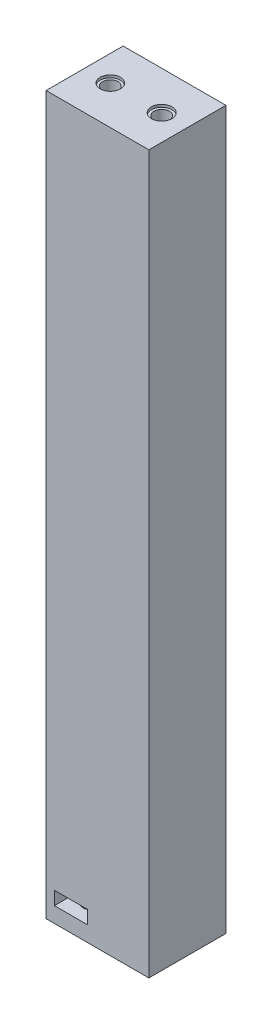
ISO-10303-21;
HEADER;
FILE_DESCRIPTION(('STEP AP214'),'2;1');
FILE_NAME('part.step','',(''),(''),'','','');
FILE_SCHEMA(('AUTOMOTIVE_DESIGN { 1 0 10303 214 1 1 1 1 }'));
ENDSEC;
DATA;
#1=APPLICATION_CONTEXT('core data for automotive mechanical design processes');
#2=APPLICATION_PROTOCOL_DEFINITION('international standard','automotive_design',2000,#1);
#3=PRODUCT_CONTEXT('',#1,'mechanical');
#4=PRODUCT('Part','Part','',(#3));
#5=PRODUCT_RELATED_PRODUCT_CATEGORY('part','',(#4));
#6=PRODUCT_DEFINITION_FORMATION('','',#4);
#7=PRODUCT_DEFINITION_CONTEXT('part definition',#1,'design');
#8=PRODUCT_DEFINITION('design','',#6,#7);
#9=PRODUCT_DEFINITION_SHAPE('','',#8);
#10=(LENGTH_UNIT() NAMED_UNIT(*) SI_UNIT(.MILLI.,.METRE.));
#11=(NAMED_UNIT(*) PLANE_ANGLE_UNIT() SI_UNIT($,.RADIAN.));
#12=(NAMED_UNIT(*) SI_UNIT($,.STERADIAN.) SOLID_ANGLE_UNIT());
#13=UNCERTAINTY_MEASURE_WITH_UNIT(LENGTH_MEASURE(1.E-05),#10,'distance_accuracy_value','');
#14=(GEOMETRIC_REPRESENTATION_CONTEXT(3) GLOBAL_UNCERTAINTY_ASSIGNED_CONTEXT((#13)) GLOBAL_UNIT_ASSIGNED_CONTEXT((#10,
#11,#12)) REPRESENTATION_CONTEXT('',''));
#15=CARTESIAN_POINT('',(0.,0.,0.));
#16=DIRECTION('',(0.,0.,1.));
#17=DIRECTION('',(1.,0.,0.));
#18=AXIS2_PLACEMENT_3D('',#15,#16,#17);
#19=CARTESIAN_POINT('',(0.,2.6,0.15));
#20=DIRECTION('',(0.,0.,1.));
#21=DIRECTION('',(1.,0.,0.));
#22=AXIS2_PLACEMENT_3D('',#19,#20,#21);
#23=PLANE('',#22);
#24=DIRECTION('',(-1.,0.,0.));
#25=VECTOR('',#24,1.);
#26=CARTESIAN_POINT('',(0.,0.,0.15));
#27=LINE('',#26,#25);
#28=CARTESIAN_POINT('',(8.2,0.,0.15));
#29=VERTEX_POINT('',#28);
#30=CARTESIAN_POINT('',(1.8,0.,0.15));
#31=VERTEX_POINT('',#30);
#32=EDGE_CURVE('E194',#29,#31,#27,.T.);
#33=ORIENTED_EDGE('',*,*,#32,.T.);
#34=DIRECTION('',(0.,-1.,0.));
#35=VECTOR('',#34,1.);
#36=CARTESIAN_POINT('',(1.8,2.6,0.15));
#37=LINE('',#36,#35);
#38=CARTESIAN_POINT('',(1.8,2.6,0.15));
#39=VERTEX_POINT('',#38);
#40=EDGE_CURVE('E11',#39,#31,#37,.T.);
#41=ORIENTED_EDGE('',*,*,#40,.F.);
#42=DIRECTION('',(-1.,0.,0.));
#43=VECTOR('',#42,1.);
#44=CARTESIAN_POINT('',(0.,2.6,0.15));
#45=LINE('',#44,#43);
#46=CARTESIAN_POINT('',(8.2,2.6,0.15));
#47=VERTEX_POINT('',#46);
#48=EDGE_CURVE('E209',#47,#39,#45,.T.);
#49=ORIENTED_EDGE('',*,*,#48,.F.);
#50=DIRECTION('',(0.,-1.,0.));
#51=VECTOR('',#50,1.);
#52=CARTESIAN_POINT('',(8.2,2.6,0.15));
#53=LINE('',#52,#51);
#54=EDGE_CURVE('E231',#47,#29,#53,.T.);
#55=ORIENTED_EDGE('',*,*,#54,.T.);
#56=EDGE_LOOP('',(#33,#41,#49,#55));
#57=FACE_BOUND('',#56,.T.);
#58=ADVANCED_FACE('F40',(#57),#23,.F.);
#59=CARTESIAN_POINT('',(1.8,2.6,0.));
#60=DIRECTION('',(-1.,0.,0.));
#61=DIRECTION('',(0.,0.,1.));
#62=AXIS2_PLACEMENT_3D('',#59,#60,#61);
#63=PLANE('',#62);
#64=DIRECTION('',(0.,0.,-1.));
#65=VECTOR('',#64,1.);
#66=CARTESIAN_POINT('',(1.8,0.,0.));
#67=LINE('',#66,#65);
#68=CARTESIAN_POINT('',(1.8,0.,-7.59292642862094));
#69=VERTEX_POINT('',#68);
#70=EDGE_CURVE('E235',#31,#69,#67,.T.);
#71=ORIENTED_EDGE('',*,*,#70,.T.);
#72=DIRECTION('',(0.,-1.,0.));
#73=VECTOR('',#72,1.);
#74=CARTESIAN_POINT('',(1.8,2.6,-7.59292642862094));
#75=LINE('',#74,#73);
#76=CARTESIAN_POINT('',(1.8,2.6,-7.59292642862094));
#77=VERTEX_POINT('',#76);
#78=EDGE_CURVE('E50',#77,#69,#75,.T.);
#79=ORIENTED_EDGE('',*,*,#78,.F.);
#80=DIRECTION('',(0.,0.,-1.));
#81=VECTOR('',#80,1.);
#82=CARTESIAN_POINT('',(1.8,2.6,0.));
#83=LINE('',#82,#81);
#84=EDGE_CURVE('E212',#39,#77,#83,.T.);
#85=ORIENTED_EDGE('',*,*,#84,.F.);
#86=ORIENTED_EDGE('',*,*,#40,.T.);
#87=EDGE_LOOP('',(#71,#79,#85,#86));
#88=FACE_BOUND('',#87,.T.);
#89=ADVANCED_FACE('F353',(#88),#63,.F.);
#90=CARTESIAN_POINT('',(-9.81414714275812,2.6,0.));
#91=DIRECTION('',(1.,0.,0.));
#92=DIRECTION('',(0.,0.,-1.));
#93=AXIS2_PLACEMENT_3D('',#90,#91,#92);
#94=PLANE('',#93);
#95=DIRECTION('',(0.,-1.,0.));
#96=VECTOR('',#95,1.);
#97=CARTESIAN_POINT('',(-9.81414714275812,2.6,-7.59292642862094));
#98=LINE('',#97,#96);
#99=CARTESIAN_POINT('',(-9.81414714275812,136.6,-7.59292642862094));
#100=VERTEX_POINT('',#99);
#101=CARTESIAN_POINT('',(-9.81414714275812,-3.,-7.59292642862094));
#102=VERTEX_POINT('',#101);
#103=EDGE_CURVE('E278',#100,#102,#98,.T.);
#104=ORIENTED_EDGE('',*,*,#103,.T.);
#105=DIRECTION('',(0.,0.,-1.));
#106=VECTOR('',#105,1.);
#107=CARTESIAN_POINT('',(-9.81414714275812,-3.,0.));
#108=LINE('',#107,#106);
#109=CARTESIAN_POINT('',(-9.81414714275812,-3.,7.40707357137906));
#110=VERTEX_POINT('',#109);
#111=EDGE_CURVE('E172',#110,#102,#108,.T.);
#112=ORIENTED_EDGE('',*,*,#111,.F.);
#113=DIRECTION('',(0.,-1.,0.));
#114=VECTOR('',#113,1.);
#115=CARTESIAN_POINT('',(-9.81414714275812,2.6,7.40707357137906));
#116=LINE('',#115,#114);
#117=CARTESIAN_POINT('',(-9.81414714275812,136.6,7.40707357137906));
#118=VERTEX_POINT('',#117);
#119=EDGE_CURVE('E275',#118,#110,#116,.T.);
#120=ORIENTED_EDGE('',*,*,#119,.F.);
#121=DIRECTION('',(0.,0.,1.));
#122=VECTOR('',#121,1.);
#123=CARTESIAN_POINT('',(-9.81414714275812,136.6,0.));
#124=LINE('',#123,#122);
#125=EDGE_CURVE('E153',#100,#118,#124,.T.);
#126=ORIENTED_EDGE('',*,*,#125,.F.);
#127=EDGE_LOOP('',(#104,#112,#120,#126));
#128=FACE_BOUND('',#127,.T.);
#129=ADVANCED_FACE('F377',(#128),#94,.F.);
#130=CARTESIAN_POINT('',(-8.2,2.6,0.));
#131=DIRECTION('',(1.,0.,0.));
#132=DIRECTION('',(0.,0.,-1.));
#133=AXIS2_PLACEMENT_3D('',#130,#131,#132);
#134=PLANE('',#133);
#135=DIRECTION('',(0.,0.,1.));
#136=VECTOR('',#135,1.);
#137=CARTESIAN_POINT('',(-8.2,0.,0.));
#138=LINE('',#137,#136);
#139=CARTESIAN_POINT('',(-8.2,0.,-0.15));
#140=VERTEX_POINT('',#139);
#141=CARTESIAN_POINT('',(-8.2,0.,7.40707357137906));
#142=VERTEX_POINT('',#141);
#143=EDGE_CURVE('E239',#140,#142,#138,.T.);
#144=ORIENTED_EDGE('',*,*,#143,.F.);
#145=DIRECTION('',(0.,-1.,0.));
#146=VECTOR('',#145,1.);
#147=CARTESIAN_POINT('',(-8.2,2.6,-0.15));
#148=LINE('',#147,#146);
#149=CARTESIAN_POINT('',(-8.2,2.6,-0.15));
#150=VERTEX_POINT('',#149);
#151=EDGE_CURVE('E267',#150,#140,#148,.T.);
#152=ORIENTED_EDGE('',*,*,#151,.F.);
#153=DIRECTION('',(0.,0.,1.));
#154=VECTOR('',#153,1.);
#155=CARTESIAN_POINT('',(-8.2,2.6,0.));
#156=LINE('',#155,#154);
#157=CARTESIAN_POINT('',(-8.2,2.6,7.40707357137906));
#158=VERTEX_POINT('',#157);
#159=EDGE_CURVE('E216',#150,#158,#156,.T.);
#160=ORIENTED_EDGE('',*,*,#159,.T.);
#161=DIRECTION('',(0.,-1.,0.));
#162=VECTOR('',#161,1.);
#163=CARTESIAN_POINT('',(-8.2,2.6,7.40707357137906));
#164=LINE('',#163,#162);
#165=EDGE_CURVE('E271',#158,#142,#164,.T.);
#166=ORIENTED_EDGE('',*,*,#165,.T.);
#167=EDGE_LOOP('',(#144,#152,#160,#166));
#168=FACE_BOUND('',#167,.T.);
#169=ADVANCED_FACE('F381',(#168),#134,.T.);
#170=CARTESIAN_POINT('',(0.,2.6,-0.15));
#171=DIRECTION('',(0.,0.,1.));
#172=DIRECTION('',(1.,0.,0.));
#173=AXIS2_PLACEMENT_3D('',#170,#171,#172);
#174=PLANE('',#173);
#175=DIRECTION('',(-1.,0.,0.));
#176=VECTOR('',#175,1.);
#177=CARTESIAN_POINT('',(0.,0.,-0.15));
#178=LINE('',#177,#176);
#179=CARTESIAN_POINT('',(-1.8,0.,-0.15));
#180=VERTEX_POINT('',#179);
#181=EDGE_CURVE('E242',#180,#140,#178,.T.);
#182=ORIENTED_EDGE('',*,*,#181,.F.);
#183=DIRECTION('',(0.,-1.,0.));
#184=VECTOR('',#183,1.);
#185=CARTESIAN_POINT('',(-1.8,2.6,-0.15));
#186=LINE('',#185,#184);
#187=CARTESIAN_POINT('',(-1.8,2.6,-0.15));
#188=VERTEX_POINT('',#187);
#189=EDGE_CURVE('E263',#188,#180,#186,.T.);
#190=ORIENTED_EDGE('',*,*,#189,.F.);
#191=DIRECTION('',(-1.,0.,0.));
#192=VECTOR('',#191,1.);
#193=CARTESIAN_POINT('',(0.,2.6,-0.15));
#194=LINE('',#193,#192);
#195=EDGE_CURVE('E220',#188,#150,#194,.T.);
#196=ORIENTED_EDGE('',*,*,#195,.T.);
#197=ORIENTED_EDGE('',*,*,#151,.T.);
#198=EDGE_LOOP('',(#182,#190,#196,#197));
#199=FACE_BOUND('',#198,.T.);
#200=ADVANCED_FACE('F387',(#199),#174,.T.);
#201=CARTESIAN_POINT('',(-1.8,2.6,0.));
#202=DIRECTION('',(1.,0.,0.));
#203=DIRECTION('',(0.,0.,-1.));
#204=AXIS2_PLACEMENT_3D('',#201,#202,#203);
#205=PLANE('',#204);
#206=DIRECTION('',(0.,0.,1.));
#207=VECTOR('',#206,1.);
#208=CARTESIAN_POINT('',(-1.8,0.,0.));
#209=LINE('',#208,#207);
#210=CARTESIAN_POINT('',(-1.8,0.,7.40707357137906));
#211=VERTEX_POINT('',#210);
#212=EDGE_CURVE('E245',#180,#211,#209,.T.);
#213=ORIENTED_EDGE('',*,*,#212,.T.);
#214=DIRECTION('',(0.,-1.,0.));
#215=VECTOR('',#214,1.);
#216=CARTESIAN_POINT('',(-1.8,2.6,7.40707357137906));
#217=LINE('',#216,#215);
#218=CARTESIAN_POINT('',(-1.8,2.6,7.40707357137906));
#219=VERTEX_POINT('',#218);
#220=EDGE_CURVE('E138',#219,#211,#217,.T.);
#221=ORIENTED_EDGE('',*,*,#220,.F.);
#222=DIRECTION('',(0.,0.,1.));
#223=VECTOR('',#222,1.);
#224=CARTESIAN_POINT('',(-1.8,2.6,0.));
#225=LINE('',#224,#223);
#226=EDGE_CURVE('E224',#188,#219,#225,.T.);
#227=ORIENTED_EDGE('',*,*,#226,.F.);
#228=ORIENTED_EDGE('',*,*,#189,.T.);
#229=EDGE_LOOP('',(#213,#221,#227,#228));
#230=FACE_BOUND('',#229,.T.);
#231=ADVANCED_FACE('F391',(#230),#205,.F.);
#232=CARTESIAN_POINT('',(0.,2.6,7.40707357137906));
#233=DIRECTION('',(0.,0.,-1.));
#234=DIRECTION('',(-1.,0.,0.));
#235=AXIS2_PLACEMENT_3D('',#232,#233,#234);
#236=PLANE('',#235);
#237=ORIENTED_EDGE('',*,*,#165,.F.);
#238=DIRECTION('',(1.,0.,0.));
#239=VECTOR('',#238,1.);
#240=CARTESIAN_POINT('',(0.,2.6,7.40707357137906));
#241=LINE('',#240,#239);
#242=EDGE_CURVE('E157',#158,#219,#241,.T.);
#243=ORIENTED_EDGE('',*,*,#242,.T.);
#244=ORIENTED_EDGE('',*,*,#220,.T.);
#245=DIRECTION('',(-1.,0.,0.));
#246=VECTOR('',#245,1.);
#247=CARTESIAN_POINT('',(0.,0.,7.40707357137906));
#248=LINE('',#247,#246);
#249=EDGE_CURVE('E198',#211,#142,#248,.T.);
#250=ORIENTED_EDGE('',*,*,#249,.T.);
#251=EDGE_LOOP('',(#237,#243,#244,#250));
#252=FACE_BOUND('',#251,.T.);
#253=DIRECTION('',(1.,0.,0.));
#254=VECTOR('',#253,1.);
#255=CARTESIAN_POINT('',(0.,136.6,7.40707357137906));
#256=LINE('',#255,#254);
#257=CARTESIAN_POINT('',(10.1858528572419,136.6,7.40707357137906));
#258=VERTEX_POINT('',#257);
#259=EDGE_CURVE('E131',#118,#258,#256,.T.);
#260=ORIENTED_EDGE('',*,*,#259,.F.);
#261=ORIENTED_EDGE('',*,*,#119,.T.);
#262=DIRECTION('',(-1.,0.,0.));
#263=VECTOR('',#262,1.);
#264=CARTESIAN_POINT('',(0.,-3.,7.40707357137906));
#265=LINE('',#264,#263);
#266=CARTESIAN_POINT('',(10.1858528572419,-3.,7.40707357137906));
#267=VERTEX_POINT('',#266);
#268=EDGE_CURVE('E133',#267,#110,#265,.T.);
#269=ORIENTED_EDGE('',*,*,#268,.F.);
#270=DIRECTION('',(0.,-1.,0.));
#271=VECTOR('',#270,1.);
#272=CARTESIAN_POINT('',(10.1858528572419,2.6,7.40707357137906));
#273=LINE('',#272,#271);
#274=EDGE_CURVE('E127',#258,#267,#273,.T.);
#275=ORIENTED_EDGE('',*,*,#274,.F.);
#276=EDGE_LOOP('',(#260,#261,#269,#275));
#277=FACE_BOUND('',#276,.T.);
#278=ADVANCED_FACE('F129',(#252,#277),#236,.F.);
#279=CARTESIAN_POINT('',(10.1858528572419,2.6,0.));
#280=DIRECTION('',(1.,0.,0.));
#281=DIRECTION('',(0.,0.,-1.));
#282=AXIS2_PLACEMENT_3D('',#279,#280,#281);
#283=PLANE('',#282);
#284=ORIENTED_EDGE('',*,*,#274,.T.);
#285=DIRECTION('',(0.,0.,1.));
#286=VECTOR('',#285,1.);
#287=CARTESIAN_POINT('',(10.1858528572419,-3.,0.));
#288=LINE('',#287,#286);
#289=CARTESIAN_POINT('',(10.1858528572419,-3.,-7.59292642862094));
#290=VERTEX_POINT('',#289);
#291=EDGE_CURVE('E181',#290,#267,#288,.T.);
#292=ORIENTED_EDGE('',*,*,#291,.F.);
#293=DIRECTION('',(0.,-1.,0.));
#294=VECTOR('',#293,1.);
#295=CARTESIAN_POINT('',(10.1858528572419,2.6,-7.59292642862094));
#296=LINE('',#295,#294);
#297=CARTESIAN_POINT('',(10.1858528572419,136.6,-7.59292642862094));
#298=VERTEX_POINT('',#297);
#299=EDGE_CURVE('E139',#298,#290,#296,.T.);
#300=ORIENTED_EDGE('',*,*,#299,.F.);
#301=DIRECTION('',(0.,0.,-1.));
#302=VECTOR('',#301,1.);
#303=CARTESIAN_POINT('',(10.1858528572419,136.6,0.));
#304=LINE('',#303,#302);
#305=EDGE_CURVE('E142',#258,#298,#304,.T.);
#306=ORIENTED_EDGE('',*,*,#305,.F.);
#307=EDGE_LOOP('',(#284,#292,#300,#306));
#308=FACE_BOUND('',#307,.T.);
#309=ADVANCED_FACE('F143',(#308),#283,.T.);
#310=CARTESIAN_POINT('',(0.,2.6,-7.59292642862094));
#311=DIRECTION('',(0.,0.,1.));
#312=DIRECTION('',(1.,0.,0.));
#313=AXIS2_PLACEMENT_3D('',#310,#311,#312);
#314=PLANE('',#313);
#315=ORIENTED_EDGE('',*,*,#103,.F.);
#316=DIRECTION('',(-1.,0.,0.));
#317=VECTOR('',#316,1.);
#318=CARTESIAN_POINT('',(0.,136.6,-7.59292642862094));
#319=LINE('',#318,#317);
#320=EDGE_CURVE('E148',#298,#100,#319,.T.);
#321=ORIENTED_EDGE('',*,*,#320,.F.);
#322=ORIENTED_EDGE('',*,*,#299,.T.);
#323=DIRECTION('',(1.,0.,0.));
#324=VECTOR('',#323,1.);
#325=CARTESIAN_POINT('',(0.,-3.,-7.59292642862094));
#326=LINE('',#325,#324);
#327=EDGE_CURVE('E176',#102,#290,#326,.T.);
#328=ORIENTED_EDGE('',*,*,#327,.F.);
#329=EDGE_LOOP('',(#315,#321,#322,#328));
#330=FACE_BOUND('',#329,.T.);
#331=DIRECTION('',(-1.,0.,0.));
#332=VECTOR('',#331,1.);
#333=CARTESIAN_POINT('',(0.,2.6,-7.59292642862094));
#334=LINE('',#333,#332);
#335=CARTESIAN_POINT('',(8.2,2.6,-7.59292642862094));
#336=VERTEX_POINT('',#335);
#337=EDGE_CURVE('E57',#336,#77,#334,.T.);
#338=ORIENTED_EDGE('',*,*,#337,.T.);
#339=ORIENTED_EDGE('',*,*,#78,.T.);
#340=DIRECTION('',(1.,0.,0.));
#341=VECTOR('',#340,1.);
#342=CARTESIAN_POINT('',(0.,0.,-7.59292642862094));
#343=LINE('',#342,#341);
#344=CARTESIAN_POINT('',(8.2,0.,-7.59292642862094));
#345=VERTEX_POINT('',#344);
#346=EDGE_CURVE('E167',#69,#345,#343,.T.);
#347=ORIENTED_EDGE('',*,*,#346,.T.);
#348=DIRECTION('',(0.,-1.,0.));
#349=VECTOR('',#348,1.);
#350=CARTESIAN_POINT('',(8.2,2.6,-7.59292642862094));
#351=LINE('',#350,#349);
#352=EDGE_CURVE('E254',#336,#345,#351,.T.);
#353=ORIENTED_EDGE('',*,*,#352,.F.);
#354=EDGE_LOOP('',(#338,#339,#347,#353));
#355=FACE_BOUND('',#354,.T.);
#356=ADVANCED_FACE('F358',(#330,#355),#314,.F.);
#357=CARTESIAN_POINT('',(8.2,2.6,0.));
#358=DIRECTION('',(-1.,0.,0.));
#359=DIRECTION('',(0.,0.,1.));
#360=AXIS2_PLACEMENT_3D('',#357,#358,#359);
#361=PLANE('',#360);
#362=DIRECTION('',(0.,0.,-1.));
#363=VECTOR('',#362,1.);
#364=CARTESIAN_POINT('',(8.2,0.,0.));
#365=LINE('',#364,#363);
#366=EDGE_CURVE('E213',#29,#345,#365,.T.);
#367=ORIENTED_EDGE('',*,*,#366,.F.);
#368=ORIENTED_EDGE('',*,*,#54,.F.);
#369=DIRECTION('',(0.,0.,-1.));
#370=VECTOR('',#369,1.);
#371=CARTESIAN_POINT('',(8.2,2.6,0.));
#372=LINE('',#371,#370);
#373=EDGE_CURVE('E227',#47,#336,#372,.T.);
#374=ORIENTED_EDGE('',*,*,#373,.T.);
#375=ORIENTED_EDGE('',*,*,#352,.T.);
#376=EDGE_LOOP('',(#367,#368,#374,#375));
#377=FACE_BOUND('',#376,.T.);
#378=ADVANCED_FACE('F360',(#377),#361,.T.);
#379=CARTESIAN_POINT('',(0.,0.,0.));
#380=DIRECTION('',(0.,-1.,0.));
#381=DIRECTION('',(0.,0.,-1.));
#382=AXIS2_PLACEMENT_3D('',#379,#380,#381);
#383=PLANE('',#382);
#384=CARTESIAN_POINT('',(5.,0.,-3.5));
#385=DIRECTION('',(0.,-1.,0.));
#386=DIRECTION('',(0.,0.,-1.));
#387=AXIS2_PLACEMENT_3D('',#384,#385,#386);
#388=CIRCLE('',#387,1.5);
#389=CARTESIAN_POINT('',(5.,0.,-5.));
#390=VERTEX_POINT('',#389);
#391=EDGE_CURVE('E177',#390,#390,#388,.T.);
#392=ORIENTED_EDGE('',*,*,#391,.T.);
#393=EDGE_LOOP('',(#392));
#394=FACE_BOUND('',#393,.T.);
#395=ORIENTED_EDGE('',*,*,#32,.F.);
#396=ORIENTED_EDGE('',*,*,#366,.T.);
#397=ORIENTED_EDGE('',*,*,#346,.F.);
#398=ORIENTED_EDGE('',*,*,#70,.F.);
#399=EDGE_LOOP('',(#395,#396,#397,#398));
#400=FACE_BOUND('',#399,.T.);
#401=ADVANCED_FACE('F356',(#394,#400),#383,.F.);
#402=CARTESIAN_POINT('',(-5.,-3.,3.5));
#403=DIRECTION('',(0.,1.,0.));
#404=DIRECTION('',(0.,0.,1.));
#405=AXIS2_PLACEMENT_3D('',#402,#403,#404);
#406=CYLINDRICAL_SURFACE('',#405,1.5);
#407=CARTESIAN_POINT('',(-5.,-3.,3.5));
#408=DIRECTION('',(0.,-1.,0.));
#409=DIRECTION('',(0.,0.,-1.));
#410=AXIS2_PLACEMENT_3D('',#407,#408,#409);
#411=CIRCLE('',#410,1.5);
#412=CARTESIAN_POINT('',(-5.,-3.,2.));
#413=VERTEX_POINT('',#412);
#414=EDGE_CURVE('E186',#413,#413,#411,.T.);
#415=ORIENTED_EDGE('',*,*,#414,.T.);
#416=EDGE_LOOP('',(#415));
#417=FACE_BOUND('',#416,.T.);
#418=CARTESIAN_POINT('',(-5.,0.,3.5));
#419=DIRECTION('',(0.,-1.,0.));
#420=DIRECTION('',(0.,0.,-1.));
#421=AXIS2_PLACEMENT_3D('',#418,#419,#420);
#422=CIRCLE('',#421,1.5);
#423=CARTESIAN_POINT('',(-5.,0.,2.));
#424=VERTEX_POINT('',#423);
#425=EDGE_CURVE('E202',#424,#424,#422,.T.);
#426=ORIENTED_EDGE('',*,*,#425,.F.);
#427=EDGE_LOOP('',(#426));
#428=FACE_BOUND('',#427,.T.);
#429=ADVANCED_FACE('F367',(#417,#428),#406,.F.);
#430=CARTESIAN_POINT('',(5.,-3.,-3.5));
#431=DIRECTION('',(0.,1.,0.));
#432=DIRECTION('',(0.,0.,1.));
#433=AXIS2_PLACEMENT_3D('',#430,#431,#432);
#434=CYLINDRICAL_SURFACE('',#433,1.5);
#435=CARTESIAN_POINT('',(5.,-3.,-3.5));
#436=DIRECTION('',(0.,-1.,0.));
#437=DIRECTION('',(0.,0.,-1.));
#438=AXIS2_PLACEMENT_3D('',#435,#436,#437);
#439=CIRCLE('',#438,1.5);
#440=CARTESIAN_POINT('',(5.,-3.,-5.));
#441=VERTEX_POINT('',#440);
#442=EDGE_CURVE('E190',#441,#441,#439,.T.);
#443=ORIENTED_EDGE('',*,*,#442,.T.);
#444=EDGE_LOOP('',(#443));
#445=FACE_BOUND('',#444,.T.);
#446=ORIENTED_EDGE('',*,*,#391,.F.);
#447=EDGE_LOOP('',(#446));
#448=FACE_BOUND('',#447,.T.);
#449=ADVANCED_FACE('F566',(#445,#448),#434,.F.);
#450=CARTESIAN_POINT('',(0.,-3.,0.));
#451=DIRECTION('',(0.,-1.,0.));
#452=DIRECTION('',(0.,0.,-1.));
#453=AXIS2_PLACEMENT_3D('',#450,#451,#452);
#454=PLANE('',#453);
#455=ORIENTED_EDGE('',*,*,#111,.T.);
#456=ORIENTED_EDGE('',*,*,#327,.T.);
#457=ORIENTED_EDGE('',*,*,#291,.T.);
#458=ORIENTED_EDGE('',*,*,#268,.T.);
#459=EDGE_LOOP('',(#455,#456,#457,#458));
#460=FACE_BOUND('',#459,.T.);
#461=ORIENTED_EDGE('',*,*,#414,.F.);
#462=EDGE_LOOP('',(#461));
#463=FACE_BOUND('',#462,.T.);
#464=ORIENTED_EDGE('',*,*,#442,.F.);
#465=EDGE_LOOP('',(#464));
#466=FACE_BOUND('',#465,.T.);
#467=ADVANCED_FACE('F564',(#460,#463,#466),#454,.T.);
#468=ORIENTED_EDGE('',*,*,#212,.F.);
#469=ORIENTED_EDGE('',*,*,#181,.T.);
#470=ORIENTED_EDGE('',*,*,#143,.T.);
#471=ORIENTED_EDGE('',*,*,#249,.F.);
#472=EDGE_LOOP('',(#468,#469,#470,#471));
#473=FACE_BOUND('',#472,.T.);
#474=ORIENTED_EDGE('',*,*,#425,.T.);
#475=EDGE_LOOP('',(#474));
#476=FACE_BOUND('',#475,.T.);
#477=ADVANCED_FACE('F343',(#473,#476),#383,.F.);
#478=CARTESIAN_POINT('',(0.,2.6,0.));
#479=DIRECTION('',(0.,1.,0.));
#480=DIRECTION('',(0.,0.,1.));
#481=AXIS2_PLACEMENT_3D('',#478,#479,#480);
#482=PLANE('',#481);
#483=CARTESIAN_POINT('',(5.,2.6,-3.5));
#484=DIRECTION('',(0.,1.,0.));
#485=DIRECTION('',(0.,0.,1.));
#486=AXIS2_PLACEMENT_3D('',#483,#484,#485);
#487=CIRCLE('',#486,1.5);
#488=CARTESIAN_POINT('',(5.,2.6,-2.));
#489=VERTEX_POINT('',#488);
#490=EDGE_CURVE('E170',#489,#489,#487,.T.);
#491=ORIENTED_EDGE('',*,*,#490,.T.);
#492=EDGE_LOOP('',(#491));
#493=FACE_BOUND('',#492,.T.);
#494=ORIENTED_EDGE('',*,*,#48,.T.);
#495=ORIENTED_EDGE('',*,*,#84,.T.);
#496=ORIENTED_EDGE('',*,*,#337,.F.);
#497=ORIENTED_EDGE('',*,*,#373,.F.);
#498=EDGE_LOOP('',(#494,#495,#496,#497));
#499=FACE_BOUND('',#498,.T.);
#500=ADVANCED_FACE('F341',(#493,#499),#482,.F.);
#501=CARTESIAN_POINT('',(0.,136.6,0.));
#502=DIRECTION('',(0.,1.,0.));
#503=DIRECTION('',(0.,0.,1.));
#504=AXIS2_PLACEMENT_3D('',#501,#502,#503);
#505=PLANE('',#504);
#506=CARTESIAN_POINT('',(-4.81414714275812,136.6,-0.0929264286209375));
#507=DIRECTION('',(0.,1.,0.));
#508=DIRECTION('',(0.,0.,1.));
#509=AXIS2_PLACEMENT_3D('',#506,#507,#508);
#510=CIRCLE('',#509,1.965);
#511=CARTESIAN_POINT('',(-4.81414714275812,136.6,1.87207357137906));
#512=VERTEX_POINT('',#511);
#513=EDGE_CURVE('E302',#512,#512,#510,.T.);
#514=ORIENTED_EDGE('',*,*,#513,.F.);
#515=EDGE_LOOP('',(#514));
#516=FACE_BOUND('',#515,.T.);
#517=CARTESIAN_POINT('',(5.18585285724188,136.6,-0.0929264286209375));
#518=DIRECTION('',(0.,1.,0.));
#519=DIRECTION('',(0.,0.,1.));
#520=AXIS2_PLACEMENT_3D('',#517,#518,#519);
#521=CIRCLE('',#520,2.);
#522=CARTESIAN_POINT('',(5.18585285724188,136.6,1.90707357137906));
#523=VERTEX_POINT('',#522);
#524=EDGE_CURVE('E314',#523,#523,#521,.T.);
#525=ORIENTED_EDGE('',*,*,#524,.F.);
#526=EDGE_LOOP('',(#525));
#527=FACE_BOUND('',#526,.T.);
#528=ORIENTED_EDGE('',*,*,#259,.T.);
#529=ORIENTED_EDGE('',*,*,#305,.T.);
#530=ORIENTED_EDGE('',*,*,#320,.T.);
#531=ORIENTED_EDGE('',*,*,#125,.T.);
#532=EDGE_LOOP('',(#528,#529,#530,#531));
#533=FACE_BOUND('',#532,.T.);
#534=ADVANCED_FACE('F151',(#516,#527,#533),#505,.T.);
#535=CARTESIAN_POINT('',(-5.,2.6,3.5));
#536=DIRECTION('',(0.,1.,0.));
#537=DIRECTION('',(0.,0.,1.));
#538=AXIS2_PLACEMENT_3D('',#535,#536,#537);
#539=CIRCLE('',#538,1.5);
#540=CARTESIAN_POINT('',(-5.,2.6,5.));
#541=VERTEX_POINT('',#540);
#542=EDGE_CURVE('E284',#541,#541,#539,.T.);
#543=ORIENTED_EDGE('',*,*,#542,.T.);
#544=EDGE_LOOP('',(#543));
#545=FACE_BOUND('',#544,.T.);
#546=ORIENTED_EDGE('',*,*,#159,.F.);
#547=ORIENTED_EDGE('',*,*,#195,.F.);
#548=ORIENTED_EDGE('',*,*,#226,.T.);
#549=ORIENTED_EDGE('',*,*,#242,.F.);
#550=EDGE_LOOP('',(#546,#547,#548,#549));
#551=FACE_BOUND('',#550,.T.);
#552=ADVANCED_FACE('F345',(#545,#551),#482,.F.);
#553=CARTESIAN_POINT('',(-5.,16.5,3.5));
#554=DIRECTION('',(0.,-1.,0.));
#555=DIRECTION('',(0.,0.,-1.));
#556=AXIS2_PLACEMENT_3D('',#553,#554,#555);
#557=CYLINDRICAL_SURFACE('',#556,1.5);
#558=CARTESIAN_POINT('',(-5.,16.5,3.5));
#559=DIRECTION('',(0.,-1.,0.));
#560=DIRECTION('',(0.,0.,-1.));
#561=AXIS2_PLACEMENT_3D('',#558,#559,#560);
#562=CIRCLE('',#561,1.5);
#563=CARTESIAN_POINT('',(-5.,16.5,2.));
#564=VERTEX_POINT('',#563);
#565=EDGE_CURVE('E288',#564,#564,#562,.T.);
#566=ORIENTED_EDGE('',*,*,#565,.F.);
#567=EDGE_LOOP('',(#566));
#568=FACE_BOUND('',#567,.T.);
#569=ORIENTED_EDGE('',*,*,#542,.F.);
#570=EDGE_LOOP('',(#569));
#571=FACE_BOUND('',#570,.T.);
#572=ADVANCED_FACE('F435',(#568,#571),#557,.F.);
#573=CARTESIAN_POINT('',(-5.,16.5,3.5));
#574=DIRECTION('',(0.,-1.,0.));
#575=DIRECTION('',(0.,0.,-1.));
#576=AXIS2_PLACEMENT_3D('',#573,#574,#575);
#577=PLANE('',#576);
#578=ORIENTED_EDGE('',*,*,#565,.T.);
#579=EDGE_LOOP('',(#578));
#580=FACE_BOUND('',#579,.T.);
#581=ADVANCED_FACE('F337',(#580),#577,.T.);
#582=CARTESIAN_POINT('',(5.,16.5,-3.5));
#583=DIRECTION('',(0.,-1.,0.));
#584=DIRECTION('',(0.,0.,-1.));
#585=AXIS2_PLACEMENT_3D('',#582,#583,#584);
#586=CYLINDRICAL_SURFACE('',#585,1.5);
#587=CARTESIAN_POINT('',(5.,16.5,-3.5));
#588=DIRECTION('',(0.,-1.,0.));
#589=DIRECTION('',(0.,0.,-1.));
#590=AXIS2_PLACEMENT_3D('',#587,#588,#589);
#591=CIRCLE('',#590,1.5);
#592=CARTESIAN_POINT('',(5.,16.5,-5.));
#593=VERTEX_POINT('',#592);
#594=EDGE_CURVE('E160',#593,#593,#591,.T.);
#595=ORIENTED_EDGE('',*,*,#594,.F.);
#596=EDGE_LOOP('',(#595));
#597=FACE_BOUND('',#596,.T.);
#598=ORIENTED_EDGE('',*,*,#490,.F.);
#599=EDGE_LOOP('',(#598));
#600=FACE_BOUND('',#599,.T.);
#601=ADVANCED_FACE('F334',(#597,#600),#586,.F.);
#602=CARTESIAN_POINT('',(5.,16.5,-3.5));
#603=DIRECTION('',(0.,-1.,0.));
#604=DIRECTION('',(0.,0.,-1.));
#605=AXIS2_PLACEMENT_3D('',#602,#603,#604);
#606=PLANE('',#605);
#607=ORIENTED_EDGE('',*,*,#594,.T.);
#608=EDGE_LOOP('',(#607));
#609=FACE_BOUND('',#608,.T.);
#610=ADVANCED_FACE('F332',(#609),#606,.T.);
#611=CARTESIAN_POINT('',(5.18585285724188,136.1,-0.0929264286209375));
#612=DIRECTION('',(0.,1.,0.));
#613=DIRECTION('',(0.,0.,1.));
#614=AXIS2_PLACEMENT_3D('',#611,#612,#613);
#615=PLANE('',#614);
#616=CARTESIAN_POINT('',(5.18585285724188,136.1,-0.0929264286209375));
#617=DIRECTION('',(0.,1.,0.));
#618=DIRECTION('',(0.,0.,1.));
#619=AXIS2_PLACEMENT_3D('',#616,#617,#618);
#620=CIRCLE('',#619,2.);
#621=CARTESIAN_POINT('',(5.18585285724188,136.1,1.90707357137906));
#622=VERTEX_POINT('',#621);
#623=EDGE_CURVE('E308',#622,#622,#620,.T.);
#624=ORIENTED_EDGE('',*,*,#623,.T.);
#625=EDGE_LOOP('',(#624));
#626=FACE_BOUND('',#625,.T.);
#627=CARTESIAN_POINT('',(5.18585285724188,136.1,-0.0929264286209375));
#628=DIRECTION('',(0.,1.,0.));
#629=DIRECTION('',(0.,0.,1.));
#630=AXIS2_PLACEMENT_3D('',#627,#628,#629);
#631=CIRCLE('',#630,1.5);
#632=CARTESIAN_POINT('',(5.18585285724188,136.1,1.40707357137906));
#633=VERTEX_POINT('',#632);
#634=EDGE_CURVE('E291',#633,#633,#631,.F.);
#635=ORIENTED_EDGE('',*,*,#634,.T.);
#636=EDGE_LOOP('',(#635));
#637=FACE_BOUND('',#636,.T.);
#638=ADVANCED_FACE('F468',(#626,#637),#615,.T.);
#639=CARTESIAN_POINT('',(5.18585285724188,136.1,-0.0929264286209375));
#640=DIRECTION('',(0.,1.,0.));
#641=DIRECTION('',(0.,0.,1.));
#642=AXIS2_PLACEMENT_3D('',#639,#640,#641);
#643=CYLINDRICAL_SURFACE('',#642,2.);
#644=ORIENTED_EDGE('',*,*,#623,.F.);
#645=EDGE_LOOP('',(#644));
#646=FACE_BOUND('',#645,.T.);
#647=ORIENTED_EDGE('',*,*,#524,.T.);
#648=EDGE_LOOP('',(#647));
#649=FACE_BOUND('',#648,.T.);
#650=ADVANCED_FACE('F515',(#646,#649),#643,.F.);
#651=CARTESIAN_POINT('',(-4.81414714275812,136.1,-0.0929264286209375));
#652=DIRECTION('',(0.,1.,0.));
#653=DIRECTION('',(0.,0.,1.));
#654=AXIS2_PLACEMENT_3D('',#651,#652,#653);
#655=PLANE('',#654);
#656=CARTESIAN_POINT('',(-4.81414714275812,136.1,-0.0929264286209375));
#657=DIRECTION('',(0.,1.,0.));
#658=DIRECTION('',(0.,0.,1.));
#659=AXIS2_PLACEMENT_3D('',#656,#657,#658);
#660=CIRCLE('',#659,1.965);
#661=CARTESIAN_POINT('',(-4.81414714275812,136.1,1.87207357137906));
#662=VERTEX_POINT('',#661);
#663=EDGE_CURVE('E294',#662,#662,#660,.T.);
#664=ORIENTED_EDGE('',*,*,#663,.T.);
#665=EDGE_LOOP('',(#664));
#666=FACE_BOUND('',#665,.T.);
#667=CARTESIAN_POINT('',(-4.81414714275812,136.1,-0.0929264286209375));
#668=DIRECTION('',(0.,1.,0.));
#669=DIRECTION('',(0.,0.,1.));
#670=AXIS2_PLACEMENT_3D('',#667,#668,#669);
#671=CIRCLE('',#670,1.5);
#672=CARTESIAN_POINT('',(-4.81414714275812,136.1,1.40707357137906));
#673=VERTEX_POINT('',#672);
#674=EDGE_CURVE('E43',#673,#673,#671,.F.);
#675=ORIENTED_EDGE('',*,*,#674,.T.);
#676=EDGE_LOOP('',(#675));
#677=FACE_BOUND('',#676,.T.);
#678=ADVANCED_FACE('F526',(#666,#677),#655,.T.);
#679=CARTESIAN_POINT('',(-4.81414714275812,136.1,-0.0929264286209375));
#680=DIRECTION('',(0.,1.,0.));
#681=DIRECTION('',(0.,0.,1.));
#682=AXIS2_PLACEMENT_3D('',#679,#680,#681);
#683=CYLINDRICAL_SURFACE('',#682,1.965);
#684=ORIENTED_EDGE('',*,*,#663,.F.);
#685=EDGE_LOOP('',(#684));
#686=FACE_BOUND('',#685,.T.);
#687=ORIENTED_EDGE('',*,*,#513,.T.);
#688=EDGE_LOOP('',(#687));
#689=FACE_BOUND('',#688,.T.);
#690=ADVANCED_FACE('F494',(#686,#689),#683,.F.);
#691=CARTESIAN_POINT('',(0.,129.6,0.));
#692=DIRECTION('',(0.,1.,0.));
#693=DIRECTION('',(0.,0.,1.));
#694=AXIS2_PLACEMENT_3D('',#691,#692,#693);
#695=PLANE('',#694);
#696=CARTESIAN_POINT('',(5.18585285724188,129.6,-0.0929264286209375));
#697=DIRECTION('',(0.,1.,0.));
#698=DIRECTION('',(0.,0.,1.));
#699=AXIS2_PLACEMENT_3D('',#696,#697,#698);
#700=CIRCLE('',#699,1.5);
#701=CARTESIAN_POINT('',(5.18585285724188,129.6,1.40707357137906));
#702=VERTEX_POINT('',#701);
#703=EDGE_CURVE('E318',#702,#702,#700,.T.);
#704=ORIENTED_EDGE('',*,*,#703,.T.);
#705=EDGE_LOOP('',(#704));
#706=FACE_BOUND('',#705,.T.);
#707=ADVANCED_FACE('F489',(#706),#695,.T.);
#708=CARTESIAN_POINT('',(5.18585285724188,129.6,-0.0929264286209375));
#709=DIRECTION('',(0.,1.,0.));
#710=DIRECTION('',(0.,0.,1.));
#711=AXIS2_PLACEMENT_3D('',#708,#709,#710);
#712=CYLINDRICAL_SURFACE('',#711,1.5);
#713=ORIENTED_EDGE('',*,*,#703,.F.);
#714=EDGE_LOOP('',(#713));
#715=FACE_BOUND('',#714,.T.);
#716=ORIENTED_EDGE('',*,*,#634,.F.);
#717=EDGE_LOOP('',(#716));
#718=FACE_BOUND('',#717,.T.);
#719=ADVANCED_FACE('F480',(#715,#718),#712,.F.);
#720=CARTESIAN_POINT('',(0.,129.6,0.));
#721=DIRECTION('',(0.,1.,0.));
#722=DIRECTION('',(0.,0.,1.));
#723=AXIS2_PLACEMENT_3D('',#720,#721,#722);
#724=PLANE('',#723);
#725=CARTESIAN_POINT('',(-4.81414714275812,129.6,-0.0929264286209375));
#726=DIRECTION('',(0.,1.,0.));
#727=DIRECTION('',(0.,0.,1.));
#728=AXIS2_PLACEMENT_3D('',#725,#726,#727);
#729=CIRCLE('',#728,1.5);
#730=CARTESIAN_POINT('',(-4.81414714275812,129.6,1.40707357137906));
#731=VERTEX_POINT('',#730);
#732=EDGE_CURVE('E300',#731,#731,#729,.T.);
#733=ORIENTED_EDGE('',*,*,#732,.T.);
#734=EDGE_LOOP('',(#733));
#735=FACE_BOUND('',#734,.T.);
#736=ADVANCED_FACE('F475',(#735),#724,.T.);
#737=CARTESIAN_POINT('',(-4.81414714275812,129.6,-0.0929264286209375));
#738=DIRECTION('',(0.,1.,0.));
#739=DIRECTION('',(0.,0.,1.));
#740=AXIS2_PLACEMENT_3D('',#737,#738,#739);
#741=CYLINDRICAL_SURFACE('',#740,1.5);
#742=ORIENTED_EDGE('',*,*,#732,.F.);
#743=EDGE_LOOP('',(#742));
#744=FACE_BOUND('',#743,.T.);
#745=ORIENTED_EDGE('',*,*,#674,.F.);
#746=EDGE_LOOP('',(#745));
#747=FACE_BOUND('',#746,.T.);
#748=ADVANCED_FACE('F479',(#744,#747),#741,.F.);
#749=CLOSED_SHELL('',(#58,#89,#129,#169,#200,#231,#278,#309,#356,#378,#401,#429,#449,#467,#477,
#500,#534,#552,#572,#581,#601,#610,#638,#650,#678,#690,#707,#719,#736,#748));
#750=MANIFOLD_SOLID_BREP('B2',#749);
#751=ADVANCED_BREP_SHAPE_REPRESENTATION('',(#18,#750),#14);
#752=SHAPE_DEFINITION_REPRESENTATION(#9,#751);
ENDSEC;
END-ISO-10303-21;
